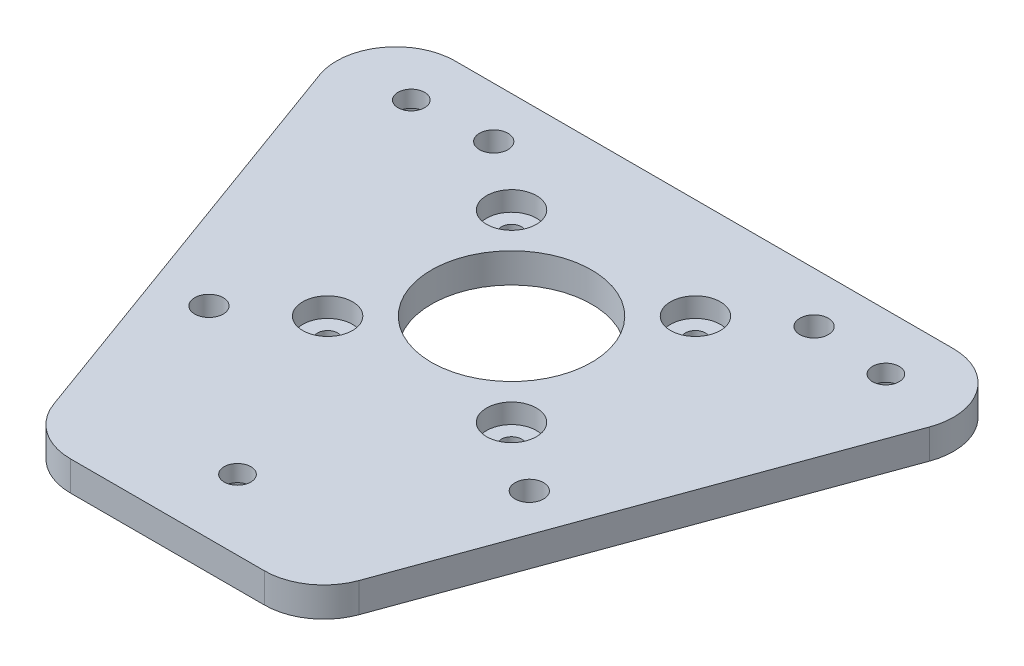
ISO-10303-21;
HEADER;
FILE_DESCRIPTION(('STEP AP214'),'2;1');
FILE_NAME('part.step','',(''),(''),'','','');
FILE_SCHEMA(('AUTOMOTIVE_DESIGN { 1 0 10303 214 1 1 1 1 }'));
ENDSEC;
DATA;
#1=APPLICATION_CONTEXT('core data for automotive mechanical design processes');
#2=APPLICATION_PROTOCOL_DEFINITION('international standard','automotive_design',2000,#1);
#3=PRODUCT_CONTEXT('',#1,'mechanical');
#4=PRODUCT('Part','Part','',(#3));
#5=PRODUCT_RELATED_PRODUCT_CATEGORY('part','',(#4));
#6=PRODUCT_DEFINITION_FORMATION('','',#4);
#7=PRODUCT_DEFINITION_CONTEXT('part definition',#1,'design');
#8=PRODUCT_DEFINITION('design','',#6,#7);
#9=PRODUCT_DEFINITION_SHAPE('','',#8);
#10=(LENGTH_UNIT() NAMED_UNIT(*) SI_UNIT(.MILLI.,.METRE.));
#11=(NAMED_UNIT(*) PLANE_ANGLE_UNIT() SI_UNIT($,.RADIAN.));
#12=(NAMED_UNIT(*) SI_UNIT($,.STERADIAN.) SOLID_ANGLE_UNIT());
#13=UNCERTAINTY_MEASURE_WITH_UNIT(LENGTH_MEASURE(1.E-05),#10,'distance_accuracy_value','');
#14=(GEOMETRIC_REPRESENTATION_CONTEXT(3) GLOBAL_UNCERTAINTY_ASSIGNED_CONTEXT((#13)) GLOBAL_UNIT_ASSIGNED_CONTEXT((#10,
#11,#12)) REPRESENTATION_CONTEXT('',''));
#15=CARTESIAN_POINT('',(0.,0.,0.));
#16=DIRECTION('',(0.,0.,1.));
#17=DIRECTION('',(1.,0.,0.));
#18=AXIS2_PLACEMENT_3D('',#15,#16,#17);
#19=CARTESIAN_POINT('',(0.,5.,0.));
#20=DIRECTION('',(0.,-1.,0.));
#21=DIRECTION('',(0.,0.,-1.));
#22=AXIS2_PLACEMENT_3D('',#19,#20,#21);
#23=PLANE('',#22);
#24=CARTESIAN_POINT('',(0.,5.,46.19));
#25=DIRECTION('',(0.,-1.,0.));
#26=DIRECTION('',(0.,0.,-1.));
#27=AXIS2_PLACEMENT_3D('',#24,#25,#26);
#28=CIRCLE('',#27,2.25);
#29=CARTESIAN_POINT('',(0.,5.,43.94));
#30=VERTEX_POINT('',#29);
#31=EDGE_CURVE('E290',#30,#30,#28,.T.);
#32=ORIENTED_EDGE('',*,*,#31,.T.);
#33=EDGE_LOOP('',(#32));
#34=FACE_BOUND('',#33,.T.);
#35=CARTESIAN_POINT('',(-40.,5.,-23.1));
#36=DIRECTION('',(0.,-1.,0.));
#37=DIRECTION('',(0.,0.,-1.));
#38=AXIS2_PLACEMENT_3D('',#35,#36,#37);
#39=CIRCLE('',#38,2.25);
#40=CARTESIAN_POINT('',(-40.,5.,-25.35));
#41=VERTEX_POINT('',#40);
#42=EDGE_CURVE('E278',#41,#41,#39,.T.);
#43=ORIENTED_EDGE('',*,*,#42,.T.);
#44=EDGE_LOOP('',(#43));
#45=FACE_BOUND('',#44,.T.);
#46=CARTESIAN_POINT('',(40.,5.,-23.1));
#47=DIRECTION('',(0.,-1.,0.));
#48=DIRECTION('',(0.,0.,-1.));
#49=AXIS2_PLACEMENT_3D('',#46,#47,#48);
#50=CIRCLE('',#49,2.25);
#51=CARTESIAN_POINT('',(40.,5.,-25.35));
#52=VERTEX_POINT('',#51);
#53=EDGE_CURVE('E266',#52,#52,#50,.T.);
#54=ORIENTED_EDGE('',*,*,#53,.T.);
#55=EDGE_LOOP('',(#54));
#56=FACE_BOUND('',#55,.T.);
#57=CARTESIAN_POINT('',(-15.5,5.,-15.5));
#58=DIRECTION('',(0.,1.,0.));
#59=DIRECTION('',(0.,0.,1.));
#60=AXIS2_PLACEMENT_3D('',#57,#58,#59);
#61=CIRCLE('',#60,4.2);
#62=CARTESIAN_POINT('',(-15.5,5.,-11.3));
#63=VERTEX_POINT('',#62);
#64=EDGE_CURVE('E263',#63,#63,#61,.T.);
#65=ORIENTED_EDGE('',*,*,#64,.F.);
#66=EDGE_LOOP('',(#65));
#67=FACE_BOUND('',#66,.T.);
#68=CARTESIAN_POINT('',(15.5,5.,-15.5));
#69=DIRECTION('',(0.,1.,0.));
#70=DIRECTION('',(0.,0.,1.));
#71=AXIS2_PLACEMENT_3D('',#68,#69,#70);
#72=CIRCLE('',#71,4.2);
#73=CARTESIAN_POINT('',(15.5,5.,-11.3));
#74=VERTEX_POINT('',#73);
#75=EDGE_CURVE('E251',#74,#74,#72,.T.);
#76=ORIENTED_EDGE('',*,*,#75,.F.);
#77=EDGE_LOOP('',(#76));
#78=FACE_BOUND('',#77,.T.);
#79=CARTESIAN_POINT('',(-15.5,5.,15.5));
#80=DIRECTION('',(0.,1.,0.));
#81=DIRECTION('',(0.,0.,1.));
#82=AXIS2_PLACEMENT_3D('',#79,#80,#81);
#83=CIRCLE('',#82,4.2);
#84=CARTESIAN_POINT('',(-15.5,5.,19.7));
#85=VERTEX_POINT('',#84);
#86=EDGE_CURVE('E227',#85,#85,#83,.T.);
#87=ORIENTED_EDGE('',*,*,#86,.F.);
#88=EDGE_LOOP('',(#87));
#89=FACE_BOUND('',#88,.T.);
#90=CARTESIAN_POINT('',(0.,5.,0.));
#91=DIRECTION('',(0.,1.,0.));
#92=DIRECTION('',(0.,0.,1.));
#93=AXIS2_PLACEMENT_3D('',#90,#91,#92);
#94=CIRCLE('',#93,13.5);
#95=CARTESIAN_POINT('',(0.,5.,13.5));
#96=VERTEX_POINT('',#95);
#97=EDGE_CURVE('E52',#96,#96,#94,.T.);
#98=ORIENTED_EDGE('',*,*,#97,.F.);
#99=EDGE_LOOP('',(#98));
#100=FACE_BOUND('',#99,.T.);
#101=CARTESIAN_POINT('',(-16.3480951115046,5.,48.));
#102=DIRECTION('',(0.,1.,0.));
#103=DIRECTION('',(0.,0.,1.));
#104=AXIS2_PLACEMENT_3D('',#101,#102,#103);
#105=CIRCLE('',#104,10.);
#106=CARTESIAN_POINT('',(-25.7449430600682,5.,51.4204164412504));
#107=VERTEX_POINT('',#106);
#108=CARTESIAN_POINT('',(-16.3480951115045,5.,58.));
#109=VERTEX_POINT('',#108);
#110=EDGE_CURVE('E149',#107,#109,#105,.T.);
#111=ORIENTED_EDGE('',*,*,#110,.T.);
#112=DIRECTION('',(1.,0.,0.));
#113=VECTOR('',#112,1.);
#114=CARTESIAN_POINT('',(-16.3480951115045,5.,58.));
#115=LINE('',#114,#113);
#116=CARTESIAN_POINT('',(16.3480951115045,5.,58.));
#117=VERTEX_POINT('',#116);
#118=EDGE_CURVE('E152',#109,#117,#115,.T.);
#119=ORIENTED_EDGE('',*,*,#118,.T.);
#120=CARTESIAN_POINT('',(16.3480951115046,5.,48.));
#121=DIRECTION('',(0.,1.,0.));
#122=DIRECTION('',(0.,0.,-1.));
#123=AXIS2_PLACEMENT_3D('',#120,#121,#122);
#124=CIRCLE('',#123,10.);
#125=CARTESIAN_POINT('',(25.7449430600682,5.,51.4204164412504));
#126=VERTEX_POINT('',#125);
#127=EDGE_CURVE('E63',#117,#126,#124,.T.);
#128=ORIENTED_EDGE('',*,*,#127,.T.);
#129=DIRECTION('',(0.342041644125043,0.,-0.939684794856359));
#130=VECTOR('',#129,1.);
#131=CARTESIAN_POINT('',(51.4066713787663,5.,-19.0795835587496));
#132=LINE('',#131,#130);
#133=CARTESIAN_POINT('',(51.4066713787663,5.,-19.0795835587496));
#134=VERTEX_POINT('',#133);
#135=EDGE_CURVE('E120',#126,#134,#132,.T.);
#136=ORIENTED_EDGE('',*,*,#135,.T.);
#137=CARTESIAN_POINT('',(42.0098234302028,5.,-22.5000000000001));
#138=DIRECTION('',(0.,1.,0.));
#139=DIRECTION('',(0.,0.,1.));
#140=AXIS2_PLACEMENT_3D('',#137,#138,#139);
#141=CIRCLE('',#140,10.);
#142=CARTESIAN_POINT('',(42.0098234302027,5.,-32.5000000000001));
#143=VERTEX_POINT('',#142);
#144=EDGE_CURVE('E158',#134,#143,#141,.T.);
#145=ORIENTED_EDGE('',*,*,#144,.T.);
#146=DIRECTION('',(-1.,0.,0.));
#147=VECTOR('',#146,1.);
#148=CARTESIAN_POINT('',(-42.0098234302027,5.,-32.5000000000001));
#149=LINE('',#148,#147);
#150=CARTESIAN_POINT('',(-42.0098234302028,5.,-32.5000000000001));
#151=VERTEX_POINT('',#150);
#152=EDGE_CURVE('E161',#143,#151,#149,.T.);
#153=ORIENTED_EDGE('',*,*,#152,.T.);
#154=CARTESIAN_POINT('',(-42.0098234302028,5.,-22.5000000000001));
#155=DIRECTION('',(0.,1.,0.));
#156=DIRECTION('',(0.,0.,-1.));
#157=AXIS2_PLACEMENT_3D('',#154,#155,#156);
#158=CIRCLE('',#157,10.);
#159=CARTESIAN_POINT('',(-51.4066713787663,5.,-19.0795835587496));
#160=VERTEX_POINT('',#159);
#161=EDGE_CURVE('E164',#151,#160,#158,.T.);
#162=ORIENTED_EDGE('',*,*,#161,.T.);
#163=DIRECTION('',(0.342041644125043,0.,0.939684794856359));
#164=VECTOR('',#163,1.);
#165=CARTESIAN_POINT('',(-51.4066713787663,5.,-19.0795835587496));
#166=LINE('',#165,#164);
#167=EDGE_CURVE('E167',#160,#107,#166,.T.);
#168=ORIENTED_EDGE('',*,*,#167,.T.);
#169=EDGE_LOOP('',(#111,#119,#128,#136,#145,#153,#162,#168));
#170=FACE_BOUND('',#169,.T.);
#171=CARTESIAN_POINT('',(-27.,5.,24.));
#172=DIRECTION('',(0.,1.,0.));
#173=DIRECTION('',(0.,0.,1.));
#174=AXIS2_PLACEMENT_3D('',#171,#172,#173);
#175=CIRCLE('',#174,2.4);
#176=CARTESIAN_POINT('',(-27.,5.,26.4));
#177=VERTEX_POINT('',#176);
#178=EDGE_CURVE('E197',#177,#177,#175,.T.);
#179=ORIENTED_EDGE('',*,*,#178,.F.);
#180=EDGE_LOOP('',(#179));
#181=FACE_BOUND('',#180,.T.);
#182=CARTESIAN_POINT('',(27.,5.,24.));
#183=DIRECTION('',(0.,1.,0.));
#184=DIRECTION('',(0.,0.,1.));
#185=AXIS2_PLACEMENT_3D('',#182,#183,#184);
#186=CIRCLE('',#185,2.4);
#187=CARTESIAN_POINT('',(27.,5.,26.4));
#188=VERTEX_POINT('',#187);
#189=EDGE_CURVE('E203',#188,#188,#186,.T.);
#190=ORIENTED_EDGE('',*,*,#189,.F.);
#191=EDGE_LOOP('',(#190));
#192=FACE_BOUND('',#191,.T.);
#193=CARTESIAN_POINT('',(27.,5.,-24.0000000000001));
#194=DIRECTION('',(0.,1.,0.));
#195=DIRECTION('',(0.,0.,1.));
#196=AXIS2_PLACEMENT_3D('',#193,#194,#195);
#197=CIRCLE('',#196,2.4);
#198=CARTESIAN_POINT('',(27.,5.,-21.6000000000001));
#199=VERTEX_POINT('',#198);
#200=EDGE_CURVE('E209',#199,#199,#197,.T.);
#201=ORIENTED_EDGE('',*,*,#200,.F.);
#202=EDGE_LOOP('',(#201));
#203=FACE_BOUND('',#202,.T.);
#204=CARTESIAN_POINT('',(-27.,5.,-24.0000000000001));
#205=DIRECTION('',(0.,1.,0.));
#206=DIRECTION('',(0.,0.,1.));
#207=AXIS2_PLACEMENT_3D('',#204,#205,#206);
#208=CIRCLE('',#207,2.4);
#209=CARTESIAN_POINT('',(-27.,5.,-21.6000000000001));
#210=VERTEX_POINT('',#209);
#211=EDGE_CURVE('E215',#210,#210,#208,.T.);
#212=ORIENTED_EDGE('',*,*,#211,.F.);
#213=EDGE_LOOP('',(#212));
#214=FACE_BOUND('',#213,.T.);
#215=CARTESIAN_POINT('',(15.5,5.,15.5));
#216=DIRECTION('',(0.,1.,0.));
#217=DIRECTION('',(0.,0.,1.));
#218=AXIS2_PLACEMENT_3D('',#215,#216,#217);
#219=CIRCLE('',#218,4.2);
#220=CARTESIAN_POINT('',(15.5,5.,19.7));
#221=VERTEX_POINT('',#220);
#222=EDGE_CURVE('E239',#221,#221,#219,.T.);
#223=ORIENTED_EDGE('',*,*,#222,.F.);
#224=EDGE_LOOP('',(#223));
#225=FACE_BOUND('',#224,.T.);
#226=ADVANCED_FACE('F48',(#34,#45,#56,#67,#78,#89,#100,#170,#181,#192,#203,#214,#225),#23,.F.);
#227=CARTESIAN_POINT('',(0.,0.,0.));
#228=DIRECTION('',(0.,-1.,0.));
#229=DIRECTION('',(0.,0.,-1.));
#230=AXIS2_PLACEMENT_3D('',#227,#228,#229);
#231=PLANE('',#230);
#232=CARTESIAN_POINT('',(0.,0.,46.19));
#233=DIRECTION('',(0.,-1.,0.));
#234=DIRECTION('',(0.,0.,-1.));
#235=AXIS2_PLACEMENT_3D('',#232,#233,#234);
#236=CIRCLE('',#235,4.3);
#237=CARTESIAN_POINT('',(0.,0.,41.89));
#238=VERTEX_POINT('',#237);
#239=EDGE_CURVE('E299',#238,#238,#236,.T.);
#240=ORIENTED_EDGE('',*,*,#239,.F.);
#241=EDGE_LOOP('',(#240));
#242=FACE_BOUND('',#241,.T.);
#243=CARTESIAN_POINT('',(-40.,0.,-23.1));
#244=DIRECTION('',(0.,-1.,0.));
#245=DIRECTION('',(0.,0.,-1.));
#246=AXIS2_PLACEMENT_3D('',#243,#244,#245);
#247=CIRCLE('',#246,4.3);
#248=CARTESIAN_POINT('',(-40.,0.,-27.4));
#249=VERTEX_POINT('',#248);
#250=EDGE_CURVE('E287',#249,#249,#247,.T.);
#251=ORIENTED_EDGE('',*,*,#250,.F.);
#252=EDGE_LOOP('',(#251));
#253=FACE_BOUND('',#252,.T.);
#254=CARTESIAN_POINT('',(40.,0.,-23.1));
#255=DIRECTION('',(0.,-1.,0.));
#256=DIRECTION('',(0.,0.,-1.));
#257=AXIS2_PLACEMENT_3D('',#254,#255,#256);
#258=CIRCLE('',#257,4.3);
#259=CARTESIAN_POINT('',(40.,0.,-27.4));
#260=VERTEX_POINT('',#259);
#261=EDGE_CURVE('E275',#260,#260,#258,.T.);
#262=ORIENTED_EDGE('',*,*,#261,.F.);
#263=EDGE_LOOP('',(#262));
#264=FACE_BOUND('',#263,.T.);
#265=CARTESIAN_POINT('',(-15.5,0.,-15.5));
#266=DIRECTION('',(0.,-1.,0.));
#267=DIRECTION('',(0.,0.,-1.));
#268=AXIS2_PLACEMENT_3D('',#265,#266,#267);
#269=CIRCLE('',#268,1.7);
#270=CARTESIAN_POINT('',(-15.5,0.,-17.2));
#271=VERTEX_POINT('',#270);
#272=EDGE_CURVE('E254',#271,#271,#269,.T.);
#273=ORIENTED_EDGE('',*,*,#272,.F.);
#274=EDGE_LOOP('',(#273));
#275=FACE_BOUND('',#274,.T.);
#276=CARTESIAN_POINT('',(15.5,0.,-15.5));
#277=DIRECTION('',(0.,-1.,0.));
#278=DIRECTION('',(0.,0.,-1.));
#279=AXIS2_PLACEMENT_3D('',#276,#277,#278);
#280=CIRCLE('',#279,1.7);
#281=CARTESIAN_POINT('',(15.5,0.,-17.2));
#282=VERTEX_POINT('',#281);
#283=EDGE_CURVE('E242',#282,#282,#280,.T.);
#284=ORIENTED_EDGE('',*,*,#283,.F.);
#285=EDGE_LOOP('',(#284));
#286=FACE_BOUND('',#285,.T.);
#287=CARTESIAN_POINT('',(15.5,0.,15.5));
#288=DIRECTION('',(0.,-1.,0.));
#289=DIRECTION('',(0.,0.,-1.));
#290=AXIS2_PLACEMENT_3D('',#287,#288,#289);
#291=CIRCLE('',#290,1.7);
#292=CARTESIAN_POINT('',(15.5,0.,13.8));
#293=VERTEX_POINT('',#292);
#294=EDGE_CURVE('E230',#293,#293,#291,.T.);
#295=ORIENTED_EDGE('',*,*,#294,.F.);
#296=EDGE_LOOP('',(#295));
#297=FACE_BOUND('',#296,.T.);
#298=CARTESIAN_POINT('',(-15.5,0.,15.5));
#299=DIRECTION('',(0.,-1.,0.));
#300=DIRECTION('',(0.,0.,-1.));
#301=AXIS2_PLACEMENT_3D('',#298,#299,#300);
#302=CIRCLE('',#301,1.7);
#303=CARTESIAN_POINT('',(-15.5,0.,13.8));
#304=VERTEX_POINT('',#303);
#305=EDGE_CURVE('E218',#304,#304,#302,.T.);
#306=ORIENTED_EDGE('',*,*,#305,.F.);
#307=EDGE_LOOP('',(#306));
#308=FACE_BOUND('',#307,.T.);
#309=CARTESIAN_POINT('',(-27.,0.,-24.0000000000001));
#310=DIRECTION('',(0.,-1.,0.));
#311=DIRECTION('',(0.,0.,-1.));
#312=AXIS2_PLACEMENT_3D('',#309,#310,#311);
#313=CIRCLE('',#312,2.4);
#314=CARTESIAN_POINT('',(-27.,0.,-26.4000000000001));
#315=VERTEX_POINT('',#314);
#316=EDGE_CURVE('E212',#315,#315,#313,.T.);
#317=ORIENTED_EDGE('',*,*,#316,.F.);
#318=EDGE_LOOP('',(#317));
#319=FACE_BOUND('',#318,.T.);
#320=CARTESIAN_POINT('',(27.,0.,-24.0000000000001));
#321=DIRECTION('',(0.,-1.,0.));
#322=DIRECTION('',(0.,0.,-1.));
#323=AXIS2_PLACEMENT_3D('',#320,#321,#322);
#324=CIRCLE('',#323,2.4);
#325=CARTESIAN_POINT('',(27.,0.,-26.4000000000001));
#326=VERTEX_POINT('',#325);
#327=EDGE_CURVE('E206',#326,#326,#324,.T.);
#328=ORIENTED_EDGE('',*,*,#327,.F.);
#329=EDGE_LOOP('',(#328));
#330=FACE_BOUND('',#329,.T.);
#331=CARTESIAN_POINT('',(27.,0.,24.));
#332=DIRECTION('',(0.,-1.,0.));
#333=DIRECTION('',(0.,0.,-1.));
#334=AXIS2_PLACEMENT_3D('',#331,#332,#333);
#335=CIRCLE('',#334,2.4);
#336=CARTESIAN_POINT('',(27.,0.,21.6));
#337=VERTEX_POINT('',#336);
#338=EDGE_CURVE('E200',#337,#337,#335,.T.);
#339=ORIENTED_EDGE('',*,*,#338,.F.);
#340=EDGE_LOOP('',(#339));
#341=FACE_BOUND('',#340,.T.);
#342=CARTESIAN_POINT('',(-27.,0.,24.));
#343=DIRECTION('',(0.,-1.,0.));
#344=DIRECTION('',(0.,0.,-1.));
#345=AXIS2_PLACEMENT_3D('',#342,#343,#344);
#346=CIRCLE('',#345,2.4);
#347=CARTESIAN_POINT('',(-27.,0.,21.6));
#348=VERTEX_POINT('',#347);
#349=EDGE_CURVE('E153',#348,#348,#346,.T.);
#350=ORIENTED_EDGE('',*,*,#349,.F.);
#351=EDGE_LOOP('',(#350));
#352=FACE_BOUND('',#351,.T.);
#353=CARTESIAN_POINT('',(0.,0.,0.));
#354=DIRECTION('',(0.,1.,0.));
#355=DIRECTION('',(0.,0.,1.));
#356=AXIS2_PLACEMENT_3D('',#353,#354,#355);
#357=CIRCLE('',#356,13.5);
#358=CARTESIAN_POINT('',(0.,0.,13.5));
#359=VERTEX_POINT('',#358);
#360=EDGE_CURVE('E13',#359,#359,#357,.T.);
#361=ORIENTED_EDGE('',*,*,#360,.T.);
#362=EDGE_LOOP('',(#361));
#363=FACE_BOUND('',#362,.T.);
#364=DIRECTION('',(1.,0.,0.));
#365=VECTOR('',#364,1.);
#366=CARTESIAN_POINT('',(-16.3480951115045,0.,58.));
#367=LINE('',#366,#365);
#368=CARTESIAN_POINT('',(-16.3480951115045,0.,58.));
#369=VERTEX_POINT('',#368);
#370=CARTESIAN_POINT('',(16.3480951115045,0.,58.));
#371=VERTEX_POINT('',#370);
#372=EDGE_CURVE('E130',#369,#371,#367,.T.);
#373=ORIENTED_EDGE('',*,*,#372,.F.);
#374=CARTESIAN_POINT('',(-16.3480951115046,0.,48.));
#375=DIRECTION('',(0.,1.,0.));
#376=DIRECTION('',(0.,0.,1.));
#377=AXIS2_PLACEMENT_3D('',#374,#375,#376);
#378=CIRCLE('',#377,10.);
#379=CARTESIAN_POINT('',(-25.7449430600682,0.,51.4204164412504));
#380=VERTEX_POINT('',#379);
#381=EDGE_CURVE('E71',#380,#369,#378,.T.);
#382=ORIENTED_EDGE('',*,*,#381,.F.);
#383=DIRECTION('',(0.342041644125043,0.,0.939684794856359));
#384=VECTOR('',#383,1.);
#385=CARTESIAN_POINT('',(-51.4066713787663,0.,-19.0795835587496));
#386=LINE('',#385,#384);
#387=CARTESIAN_POINT('',(-51.4066713787663,0.,-19.0795835587496));
#388=VERTEX_POINT('',#387);
#389=EDGE_CURVE('E145',#388,#380,#386,.T.);
#390=ORIENTED_EDGE('',*,*,#389,.F.);
#391=CARTESIAN_POINT('',(-42.0098234302028,0.,-22.5000000000001));
#392=DIRECTION('',(0.,1.,0.));
#393=DIRECTION('',(0.,0.,-1.));
#394=AXIS2_PLACEMENT_3D('',#391,#392,#393);
#395=CIRCLE('',#394,10.);
#396=CARTESIAN_POINT('',(-42.0098234302028,0.,-32.5000000000001));
#397=VERTEX_POINT('',#396);
#398=EDGE_CURVE('E142',#397,#388,#395,.T.);
#399=ORIENTED_EDGE('',*,*,#398,.F.);
#400=DIRECTION('',(-1.,0.,0.));
#401=VECTOR('',#400,1.);
#402=CARTESIAN_POINT('',(-42.0098234302027,0.,-32.5000000000001));
#403=LINE('',#402,#401);
#404=CARTESIAN_POINT('',(42.0098234302027,0.,-32.5000000000001));
#405=VERTEX_POINT('',#404);
#406=EDGE_CURVE('E136',#405,#397,#403,.T.);
#407=ORIENTED_EDGE('',*,*,#406,.F.);
#408=CARTESIAN_POINT('',(42.0098234302028,0.,-22.5000000000001));
#409=DIRECTION('',(0.,1.,0.));
#410=DIRECTION('',(0.,0.,1.));
#411=AXIS2_PLACEMENT_3D('',#408,#409,#410);
#412=CIRCLE('',#411,10.);
#413=CARTESIAN_POINT('',(51.4066713787663,0.,-19.0795835587496));
#414=VERTEX_POINT('',#413);
#415=EDGE_CURVE('E134',#414,#405,#412,.T.);
#416=ORIENTED_EDGE('',*,*,#415,.F.);
#417=DIRECTION('',(0.342041644125043,0.,-0.939684794856359));
#418=VECTOR('',#417,1.);
#419=CARTESIAN_POINT('',(51.4066713787663,0.,-19.0795835587496));
#420=LINE('',#419,#418);
#421=CARTESIAN_POINT('',(25.7449430600682,0.,51.4204164412504));
#422=VERTEX_POINT('',#421);
#423=EDGE_CURVE('E117',#422,#414,#420,.T.);
#424=ORIENTED_EDGE('',*,*,#423,.F.);
#425=CARTESIAN_POINT('',(16.3480951115046,0.,48.));
#426=DIRECTION('',(0.,1.,0.));
#427=DIRECTION('',(0.,0.,-1.));
#428=AXIS2_PLACEMENT_3D('',#425,#426,#427);
#429=CIRCLE('',#428,10.);
#430=EDGE_CURVE('E125',#371,#422,#429,.T.);
#431=ORIENTED_EDGE('',*,*,#430,.F.);
#432=EDGE_LOOP('',(#373,#382,#390,#399,#407,#416,#424,#431));
#433=FACE_BOUND('',#432,.T.);
#434=ADVANCED_FACE('F50',(#242,#253,#264,#275,#286,#297,#308,#319,#330,#341,#352,#363,#433),
#231,.T.);
#435=CARTESIAN_POINT('',(0.,0.,0.));
#436=DIRECTION('',(0.,1.,0.));
#437=DIRECTION('',(0.,0.,1.));
#438=AXIS2_PLACEMENT_3D('',#435,#436,#437);
#439=CYLINDRICAL_SURFACE('',#438,13.5);
#440=ORIENTED_EDGE('',*,*,#360,.F.);
#441=EDGE_LOOP('',(#440));
#442=FACE_BOUND('',#441,.T.);
#443=ORIENTED_EDGE('',*,*,#97,.T.);
#444=EDGE_LOOP('',(#443));
#445=FACE_BOUND('',#444,.T.);
#446=ADVANCED_FACE('F307',(#442,#445),#439,.F.);
#447=CARTESIAN_POINT('',(-16.3480951115046,0.,48.));
#448=DIRECTION('',(0.,1.,0.));
#449=DIRECTION('',(0.,0.,1.));
#450=AXIS2_PLACEMENT_3D('',#447,#448,#449);
#451=CYLINDRICAL_SURFACE('',#450,10.);
#452=ORIENTED_EDGE('',*,*,#110,.F.);
#453=DIRECTION('',(0.,1.,0.));
#454=VECTOR('',#453,1.);
#455=CARTESIAN_POINT('',(-25.7449430600682,0.,51.4204164412504));
#456=LINE('',#455,#454);
#457=EDGE_CURVE('E170',#380,#107,#456,.T.);
#458=ORIENTED_EDGE('',*,*,#457,.F.);
#459=ORIENTED_EDGE('',*,*,#381,.T.);
#460=DIRECTION('',(0.,1.,0.));
#461=VECTOR('',#460,1.);
#462=CARTESIAN_POINT('',(-16.3480951115045,0.,58.));
#463=LINE('',#462,#461);
#464=EDGE_CURVE('E148',#369,#109,#463,.T.);
#465=ORIENTED_EDGE('',*,*,#464,.T.);
#466=EDGE_LOOP('',(#452,#458,#459,#465));
#467=FACE_BOUND('',#466,.T.);
#468=ADVANCED_FACE('F182',(#467),#451,.T.);
#469=CARTESIAN_POINT('',(-51.4066713787663,0.,-19.0795835587496));
#470=DIRECTION('',(-0.939684794856359,0.,0.342041644125043));
#471=DIRECTION('',(0.342041644125043,0.,0.939684794856359));
#472=AXIS2_PLACEMENT_3D('',#469,#470,#471);
#473=PLANE('',#472);
#474=ORIENTED_EDGE('',*,*,#167,.F.);
#475=DIRECTION('',(0.,1.,0.));
#476=VECTOR('',#475,1.);
#477=CARTESIAN_POINT('',(-51.4066713787663,0.,-19.0795835587496));
#478=LINE('',#477,#476);
#479=EDGE_CURVE('E172',#388,#160,#478,.T.);
#480=ORIENTED_EDGE('',*,*,#479,.F.);
#481=ORIENTED_EDGE('',*,*,#389,.T.);
#482=ORIENTED_EDGE('',*,*,#457,.T.);
#483=EDGE_LOOP('',(#474,#480,#481,#482));
#484=FACE_BOUND('',#483,.T.);
#485=ADVANCED_FACE('F190',(#484),#473,.T.);
#486=CARTESIAN_POINT('',(-42.0098234302028,0.,-22.5000000000001));
#487=DIRECTION('',(0.,1.,0.));
#488=DIRECTION('',(0.,0.,1.));
#489=AXIS2_PLACEMENT_3D('',#486,#487,#488);
#490=CYLINDRICAL_SURFACE('',#489,10.);
#491=ORIENTED_EDGE('',*,*,#161,.F.);
#492=DIRECTION('',(0.,1.,0.));
#493=VECTOR('',#492,1.);
#494=CARTESIAN_POINT('',(-42.0098234302028,0.,-32.5000000000001));
#495=LINE('',#494,#493);
#496=EDGE_CURVE('E174',#397,#151,#495,.T.);
#497=ORIENTED_EDGE('',*,*,#496,.F.);
#498=ORIENTED_EDGE('',*,*,#398,.T.);
#499=ORIENTED_EDGE('',*,*,#479,.T.);
#500=EDGE_LOOP('',(#491,#497,#498,#499));
#501=FACE_BOUND('',#500,.T.);
#502=ADVANCED_FACE('F358',(#501),#490,.T.);
#503=CARTESIAN_POINT('',(-42.0098234302027,0.,-32.5000000000001));
#504=DIRECTION('',(0.,0.,-1.));
#505=DIRECTION('',(-1.,0.,0.));
#506=AXIS2_PLACEMENT_3D('',#503,#504,#505);
#507=PLANE('',#506);
#508=ORIENTED_EDGE('',*,*,#152,.F.);
#509=DIRECTION('',(0.,1.,0.));
#510=VECTOR('',#509,1.);
#511=CARTESIAN_POINT('',(42.0098234302027,0.,-32.5000000000001));
#512=LINE('',#511,#510);
#513=EDGE_CURVE('E176',#405,#143,#512,.T.);
#514=ORIENTED_EDGE('',*,*,#513,.F.);
#515=ORIENTED_EDGE('',*,*,#406,.T.);
#516=ORIENTED_EDGE('',*,*,#496,.T.);
#517=EDGE_LOOP('',(#508,#514,#515,#516));
#518=FACE_BOUND('',#517,.T.);
#519=ADVANCED_FACE('F354',(#518),#507,.T.);
#520=CARTESIAN_POINT('',(42.0098234302028,0.,-22.5000000000001));
#521=DIRECTION('',(0.,1.,0.));
#522=DIRECTION('',(0.,0.,1.));
#523=AXIS2_PLACEMENT_3D('',#520,#521,#522);
#524=CYLINDRICAL_SURFACE('',#523,10.);
#525=ORIENTED_EDGE('',*,*,#144,.F.);
#526=DIRECTION('',(0.,1.,0.));
#527=VECTOR('',#526,1.);
#528=CARTESIAN_POINT('',(51.4066713787663,0.,-19.0795835587496));
#529=LINE('',#528,#527);
#530=EDGE_CURVE('E121',#414,#134,#529,.T.);
#531=ORIENTED_EDGE('',*,*,#530,.F.);
#532=ORIENTED_EDGE('',*,*,#415,.T.);
#533=ORIENTED_EDGE('',*,*,#513,.T.);
#534=EDGE_LOOP('',(#525,#531,#532,#533));
#535=FACE_BOUND('',#534,.T.);
#536=ADVANCED_FACE('F351',(#535),#524,.T.);
#537=CARTESIAN_POINT('',(51.4066713787663,0.,-19.0795835587496));
#538=DIRECTION('',(0.939684794856359,0.,0.342041644125043));
#539=DIRECTION('',(0.342041644125043,0.,-0.939684794856359));
#540=AXIS2_PLACEMENT_3D('',#537,#538,#539);
#541=PLANE('',#540);
#542=ORIENTED_EDGE('',*,*,#135,.F.);
#543=DIRECTION('',(0.,1.,0.));
#544=VECTOR('',#543,1.);
#545=CARTESIAN_POINT('',(25.7449430600682,0.,51.4204164412504));
#546=LINE('',#545,#544);
#547=EDGE_CURVE('E113',#422,#126,#546,.T.);
#548=ORIENTED_EDGE('',*,*,#547,.F.);
#549=ORIENTED_EDGE('',*,*,#423,.T.);
#550=ORIENTED_EDGE('',*,*,#530,.T.);
#551=EDGE_LOOP('',(#542,#548,#549,#550));
#552=FACE_BOUND('',#551,.T.);
#553=ADVANCED_FACE('F115',(#552),#541,.T.);
#554=CARTESIAN_POINT('',(16.3480951115046,0.,48.));
#555=DIRECTION('',(0.,1.,0.));
#556=DIRECTION('',(0.,0.,1.));
#557=AXIS2_PLACEMENT_3D('',#554,#555,#556);
#558=CYLINDRICAL_SURFACE('',#557,10.);
#559=ORIENTED_EDGE('',*,*,#127,.F.);
#560=DIRECTION('',(0.,1.,0.));
#561=VECTOR('',#560,1.);
#562=CARTESIAN_POINT('',(16.3480951115045,0.,58.));
#563=LINE('',#562,#561);
#564=EDGE_CURVE('E122',#371,#117,#563,.T.);
#565=ORIENTED_EDGE('',*,*,#564,.F.);
#566=ORIENTED_EDGE('',*,*,#430,.T.);
#567=ORIENTED_EDGE('',*,*,#547,.T.);
#568=EDGE_LOOP('',(#559,#565,#566,#567));
#569=FACE_BOUND('',#568,.T.);
#570=ADVANCED_FACE('F126',(#569),#558,.T.);
#571=CARTESIAN_POINT('',(-16.3480951115045,0.,58.));
#572=DIRECTION('',(0.,0.,1.));
#573=DIRECTION('',(1.,0.,0.));
#574=AXIS2_PLACEMENT_3D('',#571,#572,#573);
#575=PLANE('',#574);
#576=ORIENTED_EDGE('',*,*,#118,.F.);
#577=ORIENTED_EDGE('',*,*,#464,.F.);
#578=ORIENTED_EDGE('',*,*,#372,.T.);
#579=ORIENTED_EDGE('',*,*,#564,.T.);
#580=EDGE_LOOP('',(#576,#577,#578,#579));
#581=FACE_BOUND('',#580,.T.);
#582=ADVANCED_FACE('F184',(#581),#575,.T.);
#583=CARTESIAN_POINT('',(-27.,5.,24.));
#584=DIRECTION('',(0.,1.,0.));
#585=DIRECTION('',(0.,0.,1.));
#586=AXIS2_PLACEMENT_3D('',#583,#584,#585);
#587=CYLINDRICAL_SURFACE('',#586,2.4);
#588=ORIENTED_EDGE('',*,*,#178,.T.);
#589=EDGE_LOOP('',(#588));
#590=FACE_BOUND('',#589,.T.);
#591=ORIENTED_EDGE('',*,*,#349,.T.);
#592=EDGE_LOOP('',(#591));
#593=FACE_BOUND('',#592,.T.);
#594=ADVANCED_FACE('F346',(#590,#593),#587,.F.);
#595=CARTESIAN_POINT('',(27.,5.,24.));
#596=DIRECTION('',(0.,1.,0.));
#597=DIRECTION('',(0.,0.,1.));
#598=AXIS2_PLACEMENT_3D('',#595,#596,#597);
#599=CYLINDRICAL_SURFACE('',#598,2.4);
#600=ORIENTED_EDGE('',*,*,#189,.T.);
#601=EDGE_LOOP('',(#600));
#602=FACE_BOUND('',#601,.T.);
#603=ORIENTED_EDGE('',*,*,#338,.T.);
#604=EDGE_LOOP('',(#603));
#605=FACE_BOUND('',#604,.T.);
#606=ADVANCED_FACE('F367',(#602,#605),#599,.F.);
#607=CARTESIAN_POINT('',(27.,5.,-24.0000000000001));
#608=DIRECTION('',(0.,1.,0.));
#609=DIRECTION('',(0.,0.,1.));
#610=AXIS2_PLACEMENT_3D('',#607,#608,#609);
#611=CYLINDRICAL_SURFACE('',#610,2.4);
#612=ORIENTED_EDGE('',*,*,#200,.T.);
#613=EDGE_LOOP('',(#612));
#614=FACE_BOUND('',#613,.T.);
#615=ORIENTED_EDGE('',*,*,#327,.T.);
#616=EDGE_LOOP('',(#615));
#617=FACE_BOUND('',#616,.T.);
#618=ADVANCED_FACE('F371',(#614,#617),#611,.F.);
#619=CARTESIAN_POINT('',(-27.,5.,-24.0000000000001));
#620=DIRECTION('',(0.,1.,0.));
#621=DIRECTION('',(0.,0.,1.));
#622=AXIS2_PLACEMENT_3D('',#619,#620,#621);
#623=CYLINDRICAL_SURFACE('',#622,2.4);
#624=ORIENTED_EDGE('',*,*,#211,.T.);
#625=EDGE_LOOP('',(#624));
#626=FACE_BOUND('',#625,.T.);
#627=ORIENTED_EDGE('',*,*,#316,.T.);
#628=EDGE_LOOP('',(#627));
#629=FACE_BOUND('',#628,.T.);
#630=ADVANCED_FACE('F375',(#626,#629),#623,.F.);
#631=CARTESIAN_POINT('',(-15.5,5.,15.5));
#632=DIRECTION('',(0.,1.,0.));
#633=DIRECTION('',(0.,0.,1.));
#634=AXIS2_PLACEMENT_3D('',#631,#632,#633);
#635=CYLINDRICAL_SURFACE('',#634,1.7);
#636=CARTESIAN_POINT('',(-15.5,1.7,15.5));
#637=DIRECTION('',(0.,1.,0.));
#638=DIRECTION('',(0.,0.,1.));
#639=AXIS2_PLACEMENT_3D('',#636,#637,#638);
#640=CIRCLE('',#639,1.7);
#641=CARTESIAN_POINT('',(-15.5,1.7,17.2));
#642=VERTEX_POINT('',#641);
#643=EDGE_CURVE('E221',#642,#642,#640,.T.);
#644=ORIENTED_EDGE('',*,*,#643,.T.);
#645=EDGE_LOOP('',(#644));
#646=FACE_BOUND('',#645,.T.);
#647=ORIENTED_EDGE('',*,*,#305,.T.);
#648=EDGE_LOOP('',(#647));
#649=FACE_BOUND('',#648,.T.);
#650=ADVANCED_FACE('F379',(#646,#649),#635,.F.);
#651=CARTESIAN_POINT('',(-13.8,1.7,15.5));
#652=DIRECTION('',(0.,-1.,0.));
#653=DIRECTION('',(0.,0.,-1.));
#654=AXIS2_PLACEMENT_3D('',#651,#652,#653);
#655=PLANE('',#654);
#656=ORIENTED_EDGE('',*,*,#643,.F.);
#657=EDGE_LOOP('',(#656));
#658=FACE_BOUND('',#657,.T.);
#659=CARTESIAN_POINT('',(-15.5,1.7,15.5));
#660=DIRECTION('',(0.,1.,0.));
#661=DIRECTION('',(0.,0.,1.));
#662=AXIS2_PLACEMENT_3D('',#659,#660,#661);
#663=CIRCLE('',#662,4.2);
#664=CARTESIAN_POINT('',(-15.5,1.7,19.7));
#665=VERTEX_POINT('',#664);
#666=EDGE_CURVE('E224',#665,#665,#663,.T.);
#667=ORIENTED_EDGE('',*,*,#666,.T.);
#668=EDGE_LOOP('',(#667));
#669=FACE_BOUND('',#668,.T.);
#670=ADVANCED_FACE('F383',(#658,#669),#655,.F.);
#671=CARTESIAN_POINT('',(-15.5,5.,15.5));
#672=DIRECTION('',(0.,1.,0.));
#673=DIRECTION('',(0.,0.,1.));
#674=AXIS2_PLACEMENT_3D('',#671,#672,#673);
#675=CYLINDRICAL_SURFACE('',#674,4.2);
#676=ORIENTED_EDGE('',*,*,#666,.F.);
#677=EDGE_LOOP('',(#676));
#678=FACE_BOUND('',#677,.T.);
#679=ORIENTED_EDGE('',*,*,#86,.T.);
#680=EDGE_LOOP('',(#679));
#681=FACE_BOUND('',#680,.T.);
#682=ADVANCED_FACE('F387',(#678,#681),#675,.F.);
#683=CARTESIAN_POINT('',(15.5,5.,15.5));
#684=DIRECTION('',(0.,1.,0.));
#685=DIRECTION('',(0.,0.,1.));
#686=AXIS2_PLACEMENT_3D('',#683,#684,#685);
#687=CYLINDRICAL_SURFACE('',#686,1.7);
#688=CARTESIAN_POINT('',(15.5,1.7,15.5));
#689=DIRECTION('',(0.,1.,0.));
#690=DIRECTION('',(0.,0.,1.));
#691=AXIS2_PLACEMENT_3D('',#688,#689,#690);
#692=CIRCLE('',#691,1.7);
#693=CARTESIAN_POINT('',(15.5,1.7,17.2));
#694=VERTEX_POINT('',#693);
#695=EDGE_CURVE('E233',#694,#694,#692,.T.);
#696=ORIENTED_EDGE('',*,*,#695,.T.);
#697=EDGE_LOOP('',(#696));
#698=FACE_BOUND('',#697,.T.);
#699=ORIENTED_EDGE('',*,*,#294,.T.);
#700=EDGE_LOOP('',(#699));
#701=FACE_BOUND('',#700,.T.);
#702=ADVANCED_FACE('F391',(#698,#701),#687,.F.);
#703=CARTESIAN_POINT('',(17.2,1.7,15.5));
#704=DIRECTION('',(0.,-1.,0.));
#705=DIRECTION('',(0.,0.,-1.));
#706=AXIS2_PLACEMENT_3D('',#703,#704,#705);
#707=PLANE('',#706);
#708=ORIENTED_EDGE('',*,*,#695,.F.);
#709=EDGE_LOOP('',(#708));
#710=FACE_BOUND('',#709,.T.);
#711=CARTESIAN_POINT('',(15.5,1.7,15.5));
#712=DIRECTION('',(0.,1.,0.));
#713=DIRECTION('',(0.,0.,1.));
#714=AXIS2_PLACEMENT_3D('',#711,#712,#713);
#715=CIRCLE('',#714,4.2);
#716=CARTESIAN_POINT('',(15.5,1.7,19.7));
#717=VERTEX_POINT('',#716);
#718=EDGE_CURVE('E236',#717,#717,#715,.T.);
#719=ORIENTED_EDGE('',*,*,#718,.T.);
#720=EDGE_LOOP('',(#719));
#721=FACE_BOUND('',#720,.T.);
#722=ADVANCED_FACE('F395',(#710,#721),#707,.F.);
#723=CARTESIAN_POINT('',(15.5,5.,15.5));
#724=DIRECTION('',(0.,1.,0.));
#725=DIRECTION('',(0.,0.,1.));
#726=AXIS2_PLACEMENT_3D('',#723,#724,#725);
#727=CYLINDRICAL_SURFACE('',#726,4.2);
#728=ORIENTED_EDGE('',*,*,#718,.F.);
#729=EDGE_LOOP('',(#728));
#730=FACE_BOUND('',#729,.T.);
#731=ORIENTED_EDGE('',*,*,#222,.T.);
#732=EDGE_LOOP('',(#731));
#733=FACE_BOUND('',#732,.T.);
#734=ADVANCED_FACE('F399',(#730,#733),#727,.F.);
#735=CARTESIAN_POINT('',(15.5,5.,-15.5));
#736=DIRECTION('',(0.,1.,0.));
#737=DIRECTION('',(0.,0.,1.));
#738=AXIS2_PLACEMENT_3D('',#735,#736,#737);
#739=CYLINDRICAL_SURFACE('',#738,1.7);
#740=CARTESIAN_POINT('',(15.5,1.7,-15.5));
#741=DIRECTION('',(0.,1.,0.));
#742=DIRECTION('',(0.,0.,1.));
#743=AXIS2_PLACEMENT_3D('',#740,#741,#742);
#744=CIRCLE('',#743,1.7);
#745=CARTESIAN_POINT('',(15.5,1.7,-13.8));
#746=VERTEX_POINT('',#745);
#747=EDGE_CURVE('E245',#746,#746,#744,.T.);
#748=ORIENTED_EDGE('',*,*,#747,.T.);
#749=EDGE_LOOP('',(#748));
#750=FACE_BOUND('',#749,.T.);
#751=ORIENTED_EDGE('',*,*,#283,.T.);
#752=EDGE_LOOP('',(#751));
#753=FACE_BOUND('',#752,.T.);
#754=ADVANCED_FACE('F403',(#750,#753),#739,.F.);
#755=CARTESIAN_POINT('',(17.2,1.7,-15.5));
#756=DIRECTION('',(0.,-1.,0.));
#757=DIRECTION('',(0.,0.,-1.));
#758=AXIS2_PLACEMENT_3D('',#755,#756,#757);
#759=PLANE('',#758);
#760=ORIENTED_EDGE('',*,*,#747,.F.);
#761=EDGE_LOOP('',(#760));
#762=FACE_BOUND('',#761,.T.);
#763=CARTESIAN_POINT('',(15.5,1.7,-15.5));
#764=DIRECTION('',(0.,1.,0.));
#765=DIRECTION('',(0.,0.,1.));
#766=AXIS2_PLACEMENT_3D('',#763,#764,#765);
#767=CIRCLE('',#766,4.2);
#768=CARTESIAN_POINT('',(15.5,1.7,-11.3));
#769=VERTEX_POINT('',#768);
#770=EDGE_CURVE('E248',#769,#769,#767,.T.);
#771=ORIENTED_EDGE('',*,*,#770,.T.);
#772=EDGE_LOOP('',(#771));
#773=FACE_BOUND('',#772,.T.);
#774=ADVANCED_FACE('F407',(#762,#773),#759,.F.);
#775=CARTESIAN_POINT('',(15.5,5.,-15.5));
#776=DIRECTION('',(0.,1.,0.));
#777=DIRECTION('',(0.,0.,1.));
#778=AXIS2_PLACEMENT_3D('',#775,#776,#777);
#779=CYLINDRICAL_SURFACE('',#778,4.2);
#780=ORIENTED_EDGE('',*,*,#770,.F.);
#781=EDGE_LOOP('',(#780));
#782=FACE_BOUND('',#781,.T.);
#783=ORIENTED_EDGE('',*,*,#75,.T.);
#784=EDGE_LOOP('',(#783));
#785=FACE_BOUND('',#784,.T.);
#786=ADVANCED_FACE('F411',(#782,#785),#779,.F.);
#787=CARTESIAN_POINT('',(-15.5,5.,-15.5));
#788=DIRECTION('',(0.,1.,0.));
#789=DIRECTION('',(0.,0.,1.));
#790=AXIS2_PLACEMENT_3D('',#787,#788,#789);
#791=CYLINDRICAL_SURFACE('',#790,1.7);
#792=CARTESIAN_POINT('',(-15.5,1.7,-15.5));
#793=DIRECTION('',(0.,1.,0.));
#794=DIRECTION('',(0.,0.,1.));
#795=AXIS2_PLACEMENT_3D('',#792,#793,#794);
#796=CIRCLE('',#795,1.7);
#797=CARTESIAN_POINT('',(-15.5,1.7,-13.8));
#798=VERTEX_POINT('',#797);
#799=EDGE_CURVE('E257',#798,#798,#796,.T.);
#800=ORIENTED_EDGE('',*,*,#799,.T.);
#801=EDGE_LOOP('',(#800));
#802=FACE_BOUND('',#801,.T.);
#803=ORIENTED_EDGE('',*,*,#272,.T.);
#804=EDGE_LOOP('',(#803));
#805=FACE_BOUND('',#804,.T.);
#806=ADVANCED_FACE('F415',(#802,#805),#791,.F.);
#807=CARTESIAN_POINT('',(-13.8,1.7,-15.5));
#808=DIRECTION('',(0.,-1.,0.));
#809=DIRECTION('',(0.,0.,-1.));
#810=AXIS2_PLACEMENT_3D('',#807,#808,#809);
#811=PLANE('',#810);
#812=ORIENTED_EDGE('',*,*,#799,.F.);
#813=EDGE_LOOP('',(#812));
#814=FACE_BOUND('',#813,.T.);
#815=CARTESIAN_POINT('',(-15.5,1.7,-15.5));
#816=DIRECTION('',(0.,1.,0.));
#817=DIRECTION('',(0.,0.,1.));
#818=AXIS2_PLACEMENT_3D('',#815,#816,#817);
#819=CIRCLE('',#818,4.2);
#820=CARTESIAN_POINT('',(-15.5,1.7,-11.3));
#821=VERTEX_POINT('',#820);
#822=EDGE_CURVE('E260',#821,#821,#819,.T.);
#823=ORIENTED_EDGE('',*,*,#822,.T.);
#824=EDGE_LOOP('',(#823));
#825=FACE_BOUND('',#824,.T.);
#826=ADVANCED_FACE('F419',(#814,#825),#811,.F.);
#827=CARTESIAN_POINT('',(-15.5,5.,-15.5));
#828=DIRECTION('',(0.,1.,0.));
#829=DIRECTION('',(0.,0.,1.));
#830=AXIS2_PLACEMENT_3D('',#827,#828,#829);
#831=CYLINDRICAL_SURFACE('',#830,4.2);
#832=ORIENTED_EDGE('',*,*,#822,.F.);
#833=EDGE_LOOP('',(#832));
#834=FACE_BOUND('',#833,.T.);
#835=ORIENTED_EDGE('',*,*,#64,.T.);
#836=EDGE_LOOP('',(#835));
#837=FACE_BOUND('',#836,.T.);
#838=ADVANCED_FACE('F423',(#834,#837),#831,.F.);
#839=CARTESIAN_POINT('',(40.,0.,-23.1));
#840=DIRECTION('',(0.,-1.,0.));
#841=DIRECTION('',(0.,0.,-1.));
#842=AXIS2_PLACEMENT_3D('',#839,#840,#841);
#843=CYLINDRICAL_SURFACE('',#842,2.25);
#844=ORIENTED_EDGE('',*,*,#53,.F.);
#845=EDGE_LOOP('',(#844));
#846=FACE_BOUND('',#845,.T.);
#847=CARTESIAN_POINT('',(40.,2.2,-23.1));
#848=DIRECTION('',(0.,-1.,0.));
#849=DIRECTION('',(0.,0.,-1.));
#850=AXIS2_PLACEMENT_3D('',#847,#848,#849);
#851=CIRCLE('',#850,2.25);
#852=CARTESIAN_POINT('',(40.,2.2,-25.35));
#853=VERTEX_POINT('',#852);
#854=EDGE_CURVE('E269',#853,#853,#851,.T.);
#855=ORIENTED_EDGE('',*,*,#854,.T.);
#856=EDGE_LOOP('',(#855));
#857=FACE_BOUND('',#856,.T.);
#858=ADVANCED_FACE('F427',(#846,#857),#843,.F.);
#859=CARTESIAN_POINT('',(42.25,2.2,-23.1));
#860=DIRECTION('',(0.,1.,0.));
#861=DIRECTION('',(0.,0.,1.));
#862=AXIS2_PLACEMENT_3D('',#859,#860,#861);
#863=PLANE('',#862);
#864=ORIENTED_EDGE('',*,*,#854,.F.);
#865=EDGE_LOOP('',(#864));
#866=FACE_BOUND('',#865,.T.);
#867=CARTESIAN_POINT('',(40.,2.2,-23.1));
#868=DIRECTION('',(0.,-1.,0.));
#869=DIRECTION('',(0.,0.,-1.));
#870=AXIS2_PLACEMENT_3D('',#867,#868,#869);
#871=CIRCLE('',#870,4.3);
#872=CARTESIAN_POINT('',(40.,2.2,-27.4));
#873=VERTEX_POINT('',#872);
#874=EDGE_CURVE('E272',#873,#873,#871,.T.);
#875=ORIENTED_EDGE('',*,*,#874,.T.);
#876=EDGE_LOOP('',(#875));
#877=FACE_BOUND('',#876,.T.);
#878=ADVANCED_FACE('F431',(#866,#877),#863,.F.);
#879=CARTESIAN_POINT('',(40.,0.,-23.1));
#880=DIRECTION('',(0.,-1.,0.));
#881=DIRECTION('',(0.,0.,-1.));
#882=AXIS2_PLACEMENT_3D('',#879,#880,#881);
#883=CYLINDRICAL_SURFACE('',#882,4.3);
#884=ORIENTED_EDGE('',*,*,#874,.F.);
#885=EDGE_LOOP('',(#884));
#886=FACE_BOUND('',#885,.T.);
#887=ORIENTED_EDGE('',*,*,#261,.T.);
#888=EDGE_LOOP('',(#887));
#889=FACE_BOUND('',#888,.T.);
#890=ADVANCED_FACE('F435',(#886,#889),#883,.F.);
#891=CARTESIAN_POINT('',(-40.,0.,-23.1));
#892=DIRECTION('',(0.,-1.,0.));
#893=DIRECTION('',(0.,0.,-1.));
#894=AXIS2_PLACEMENT_3D('',#891,#892,#893);
#895=CYLINDRICAL_SURFACE('',#894,2.25);
#896=ORIENTED_EDGE('',*,*,#42,.F.);
#897=EDGE_LOOP('',(#896));
#898=FACE_BOUND('',#897,.T.);
#899=CARTESIAN_POINT('',(-40.,2.2,-23.1));
#900=DIRECTION('',(0.,-1.,0.));
#901=DIRECTION('',(0.,0.,-1.));
#902=AXIS2_PLACEMENT_3D('',#899,#900,#901);
#903=CIRCLE('',#902,2.25);
#904=CARTESIAN_POINT('',(-40.,2.2,-25.35));
#905=VERTEX_POINT('',#904);
#906=EDGE_CURVE('E281',#905,#905,#903,.T.);
#907=ORIENTED_EDGE('',*,*,#906,.T.);
#908=EDGE_LOOP('',(#907));
#909=FACE_BOUND('',#908,.T.);
#910=ADVANCED_FACE('F439',(#898,#909),#895,.F.);
#911=CARTESIAN_POINT('',(-37.75,2.2,-23.1));
#912=DIRECTION('',(0.,1.,0.));
#913=DIRECTION('',(0.,0.,1.));
#914=AXIS2_PLACEMENT_3D('',#911,#912,#913);
#915=PLANE('',#914);
#916=ORIENTED_EDGE('',*,*,#906,.F.);
#917=EDGE_LOOP('',(#916));
#918=FACE_BOUND('',#917,.T.);
#919=CARTESIAN_POINT('',(-40.,2.2,-23.1));
#920=DIRECTION('',(0.,-1.,0.));
#921=DIRECTION('',(0.,0.,-1.));
#922=AXIS2_PLACEMENT_3D('',#919,#920,#921);
#923=CIRCLE('',#922,4.3);
#924=CARTESIAN_POINT('',(-40.,2.2,-27.4));
#925=VERTEX_POINT('',#924);
#926=EDGE_CURVE('E284',#925,#925,#923,.T.);
#927=ORIENTED_EDGE('',*,*,#926,.T.);
#928=EDGE_LOOP('',(#927));
#929=FACE_BOUND('',#928,.T.);
#930=ADVANCED_FACE('F443',(#918,#929),#915,.F.);
#931=CARTESIAN_POINT('',(-40.,0.,-23.1));
#932=DIRECTION('',(0.,-1.,0.));
#933=DIRECTION('',(0.,0.,-1.));
#934=AXIS2_PLACEMENT_3D('',#931,#932,#933);
#935=CYLINDRICAL_SURFACE('',#934,4.3);
#936=ORIENTED_EDGE('',*,*,#926,.F.);
#937=EDGE_LOOP('',(#936));
#938=FACE_BOUND('',#937,.T.);
#939=ORIENTED_EDGE('',*,*,#250,.T.);
#940=EDGE_LOOP('',(#939));
#941=FACE_BOUND('',#940,.T.);
#942=ADVANCED_FACE('F447',(#938,#941),#935,.F.);
#943=CARTESIAN_POINT('',(0.,0.,46.19));
#944=DIRECTION('',(0.,-1.,0.));
#945=DIRECTION('',(0.,0.,-1.));
#946=AXIS2_PLACEMENT_3D('',#943,#944,#945);
#947=CYLINDRICAL_SURFACE('',#946,2.25);
#948=ORIENTED_EDGE('',*,*,#31,.F.);
#949=EDGE_LOOP('',(#948));
#950=FACE_BOUND('',#949,.T.);
#951=CARTESIAN_POINT('',(0.,2.2,46.19));
#952=DIRECTION('',(0.,-1.,0.));
#953=DIRECTION('',(0.,0.,-1.));
#954=AXIS2_PLACEMENT_3D('',#951,#952,#953);
#955=CIRCLE('',#954,2.25);
#956=CARTESIAN_POINT('',(0.,2.2,43.94));
#957=VERTEX_POINT('',#956);
#958=EDGE_CURVE('E293',#957,#957,#955,.T.);
#959=ORIENTED_EDGE('',*,*,#958,.T.);
#960=EDGE_LOOP('',(#959));
#961=FACE_BOUND('',#960,.T.);
#962=ADVANCED_FACE('F451',(#950,#961),#947,.F.);
#963=CARTESIAN_POINT('',(2.25,2.2,46.19));
#964=DIRECTION('',(0.,1.,0.));
#965=DIRECTION('',(0.,0.,1.));
#966=AXIS2_PLACEMENT_3D('',#963,#964,#965);
#967=PLANE('',#966);
#968=ORIENTED_EDGE('',*,*,#958,.F.);
#969=EDGE_LOOP('',(#968));
#970=FACE_BOUND('',#969,.T.);
#971=CARTESIAN_POINT('',(0.,2.2,46.19));
#972=DIRECTION('',(0.,-1.,0.));
#973=DIRECTION('',(0.,0.,-1.));
#974=AXIS2_PLACEMENT_3D('',#971,#972,#973);
#975=CIRCLE('',#974,4.3);
#976=CARTESIAN_POINT('',(0.,2.2,41.89));
#977=VERTEX_POINT('',#976);
#978=EDGE_CURVE('E296',#977,#977,#975,.T.);
#979=ORIENTED_EDGE('',*,*,#978,.T.);
#980=EDGE_LOOP('',(#979));
#981=FACE_BOUND('',#980,.T.);
#982=ADVANCED_FACE('F455',(#970,#981),#967,.F.);
#983=CARTESIAN_POINT('',(0.,0.,46.19));
#984=DIRECTION('',(0.,-1.,0.));
#985=DIRECTION('',(0.,0.,-1.));
#986=AXIS2_PLACEMENT_3D('',#983,#984,#985);
#987=CYLINDRICAL_SURFACE('',#986,4.3);
#988=ORIENTED_EDGE('',*,*,#978,.F.);
#989=EDGE_LOOP('',(#988));
#990=FACE_BOUND('',#989,.T.);
#991=ORIENTED_EDGE('',*,*,#239,.T.);
#992=EDGE_LOOP('',(#991));
#993=FACE_BOUND('',#992,.T.);
#994=ADVANCED_FACE('F303',(#990,#993),#987,.F.);
#995=CLOSED_SHELL('',(#226,#434,#446,#468,#485,#502,#519,#536,#553,#570,#582,#594,#606,#618,
#630,#650,#670,#682,#702,#722,#734,#754,#774,#786,#806,#826,#838,#858,#878,#890,#910,#930,#942,
#962,#982,#994));
#996=MANIFOLD_SOLID_BREP('B2',#995);
#997=ADVANCED_BREP_SHAPE_REPRESENTATION('',(#18,#996),#14);
#998=SHAPE_DEFINITION_REPRESENTATION(#9,#997);
ENDSEC;
END-ISO-10303-21;
